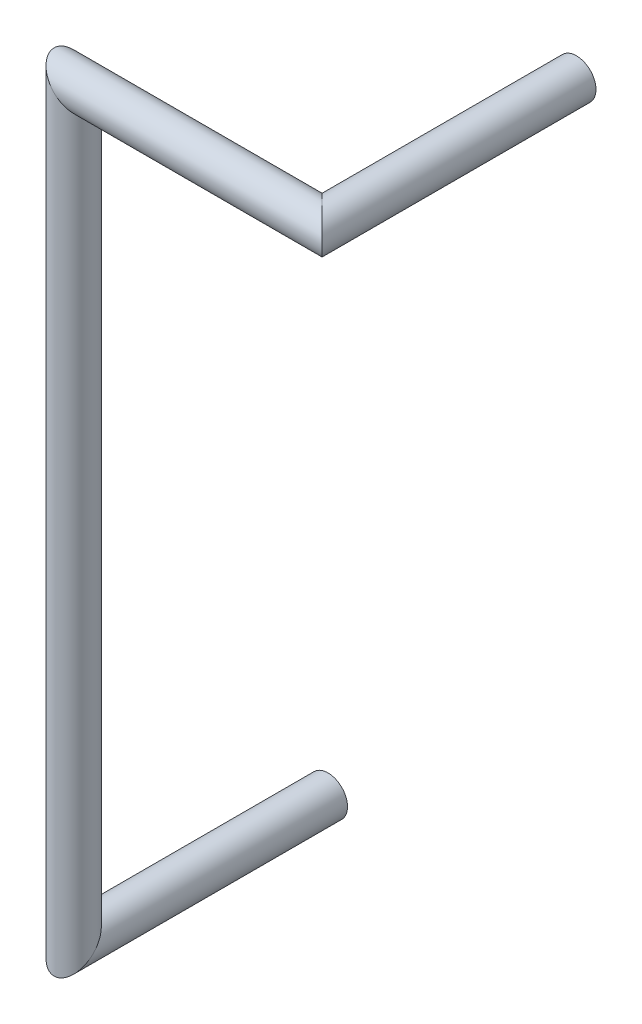
ISO-10303-21;
HEADER;
FILE_DESCRIPTION(('STEP AP214'),'2;1');
FILE_NAME('part.step','',(''),(''),'','','');
FILE_SCHEMA(('AUTOMOTIVE_DESIGN { 1 0 10303 214 1 1 1 1 }'));
ENDSEC;
DATA;
#1=APPLICATION_CONTEXT('core data for automotive mechanical design processes');
#2=APPLICATION_PROTOCOL_DEFINITION('international standard','automotive_design',2000,#1);
#3=PRODUCT_CONTEXT('',#1,'mechanical');
#4=PRODUCT('Part','Part','',(#3));
#5=PRODUCT_RELATED_PRODUCT_CATEGORY('part','',(#4));
#6=PRODUCT_DEFINITION_FORMATION('','',#4);
#7=PRODUCT_DEFINITION_CONTEXT('part definition',#1,'design');
#8=PRODUCT_DEFINITION('design','',#6,#7);
#9=PRODUCT_DEFINITION_SHAPE('','',#8);
#10=(LENGTH_UNIT() NAMED_UNIT(*) SI_UNIT(.MILLI.,.METRE.));
#11=(NAMED_UNIT(*) PLANE_ANGLE_UNIT() SI_UNIT($,.RADIAN.));
#12=(NAMED_UNIT(*) SI_UNIT($,.STERADIAN.) SOLID_ANGLE_UNIT());
#13=UNCERTAINTY_MEASURE_WITH_UNIT(LENGTH_MEASURE(1.E-05),#10,'distance_accuracy_value','');
#14=(GEOMETRIC_REPRESENTATION_CONTEXT(3) GLOBAL_UNCERTAINTY_ASSIGNED_CONTEXT((#13)) GLOBAL_UNIT_ASSIGNED_CONTEXT((#10,
#11,#12)) REPRESENTATION_CONTEXT('',''));
#15=CARTESIAN_POINT('',(0.,0.,0.));
#16=DIRECTION('',(0.,0.,1.));
#17=DIRECTION('',(1.,0.,0.));
#18=AXIS2_PLACEMENT_3D('',#15,#16,#17);
#19=CARTESIAN_POINT('',(2.54,7.62,0.));
#20=DIRECTION('',(0.,0.,1.));
#21=DIRECTION('',(1.,0.,0.));
#22=AXIS2_PLACEMENT_3D('',#19,#20,#21);
#23=PLANE('',#22);
#24=CARTESIAN_POINT('',(2.54,7.62,0.));
#25=DIRECTION('',(0.,0.,1.));
#26=DIRECTION('',(1.,0.,0.));
#27=AXIS2_PLACEMENT_3D('',#24,#25,#26);
#28=CIRCLE('',#27,0.2);
#29=CARTESIAN_POINT('',(2.74,7.62,0.));
#30=VERTEX_POINT('',#29);
#31=EDGE_CURVE('E58',#30,#30,#28,.T.);
#32=ORIENTED_EDGE('',*,*,#31,.F.);
#33=EDGE_LOOP('',(#32));
#34=FACE_BOUND('',#33,.T.);
#35=ADVANCED_FACE('F55',(#34),#23,.F.);
#36=CARTESIAN_POINT('',(0.,0.,0.));
#37=DIRECTION('',(0.,0.,-1.));
#38=DIRECTION('',(0.,-1.,0.));
#39=AXIS2_PLACEMENT_3D('',#36,#37,#38);
#40=PLANE('',#39);
#41=CARTESIAN_POINT('',(0.,0.,0.));
#42=DIRECTION('',(0.,0.,-1.));
#43=DIRECTION('',(0.,-1.,0.));
#44=AXIS2_PLACEMENT_3D('',#41,#42,#43);
#45=CIRCLE('',#44,0.2);
#46=CARTESIAN_POINT('',(0.,-0.2,0.));
#47=VERTEX_POINT('',#46);
#48=EDGE_CURVE('E63',#47,#47,#45,.T.);
#49=ORIENTED_EDGE('',*,*,#48,.T.);
#50=EDGE_LOOP('',(#49));
#51=FACE_BOUND('',#50,.T.);
#52=ADVANCED_FACE('F86',(#51),#40,.T.);
#53=CARTESIAN_POINT('',(2.54,7.62,2.92));
#54=DIRECTION('',(0.,0.,-1.));
#55=DIRECTION('',(-1.,0.,0.));
#56=AXIS2_PLACEMENT_3D('',#53,#54,#55);
#57=CYLINDRICAL_SURFACE('',#56,0.2);
#58=CARTESIAN_POINT('',(2.54,7.62,2.6));
#59=DIRECTION('',(0.707106781186548,0.,-0.707106781186548));
#60=DIRECTION('',(0.707106781186548,0.,0.707106781186548));
#61=AXIS2_PLACEMENT_3D('',#58,#59,#60);
#62=ELLIPSE('',#61,0.282842712474619,0.2);
#63=CARTESIAN_POINT('',(2.74,7.62,2.8));
#64=VERTEX_POINT('',#63);
#65=EDGE_CURVE('E74',#64,#64,#62,.T.);
#66=ORIENTED_EDGE('',*,*,#65,.T.);
#67=EDGE_LOOP('',(#66));
#68=FACE_BOUND('',#67,.T.);
#69=ORIENTED_EDGE('',*,*,#31,.T.);
#70=EDGE_LOOP('',(#69));
#71=FACE_BOUND('',#70,.T.);
#72=ADVANCED_FACE('F83',(#68,#71),#57,.T.);
#73=CARTESIAN_POINT('',(-0.539999999999999,7.62,2.6));
#74=DIRECTION('',(1.,0.,0.));
#75=DIRECTION('',(0.,0.,-1.));
#76=AXIS2_PLACEMENT_3D('',#73,#74,#75);
#77=CYLINDRICAL_SURFACE('',#76,0.2);
#78=CARTESIAN_POINT('',(0.,7.62,2.6));
#79=DIRECTION('',(0.707106781186548,0.707106781186548,0.));
#80=DIRECTION('',(-0.707106781186548,0.707106781186548,0.));
#81=AXIS2_PLACEMENT_3D('',#78,#79,#80);
#82=ELLIPSE('',#81,0.282842712474619,0.2);
#83=CARTESIAN_POINT('',(-0.2,7.82,2.6));
#84=VERTEX_POINT('',#83);
#85=EDGE_CURVE('E69',#84,#84,#82,.T.);
#86=ORIENTED_EDGE('',*,*,#85,.T.);
#87=EDGE_LOOP('',(#86));
#88=FACE_BOUND('',#87,.T.);
#89=ORIENTED_EDGE('',*,*,#65,.F.);
#90=EDGE_LOOP('',(#89));
#91=FACE_BOUND('',#90,.T.);
#92=ADVANCED_FACE('F99',(#88,#91),#77,.T.);
#93=CARTESIAN_POINT('',(0.,-0.32,2.6));
#94=DIRECTION('',(0.,1.,0.));
#95=DIRECTION('',(-1.,0.,0.));
#96=AXIS2_PLACEMENT_3D('',#93,#94,#95);
#97=CYLINDRICAL_SURFACE('',#96,0.2);
#98=CARTESIAN_POINT('',(0.,0.,2.6));
#99=DIRECTION('',(0.,0.707106781186548,0.707106781186548));
#100=DIRECTION('',(0.,-0.707106781186548,0.707106781186548));
#101=AXIS2_PLACEMENT_3D('',#98,#99,#100);
#102=ELLIPSE('',#101,0.282842712474619,0.2);
#103=CARTESIAN_POINT('',(0.,-0.2,2.8));
#104=VERTEX_POINT('',#103);
#105=EDGE_CURVE('E11',#104,#104,#102,.T.);
#106=ORIENTED_EDGE('',*,*,#105,.T.);
#107=EDGE_LOOP('',(#106));
#108=FACE_BOUND('',#107,.T.);
#109=ORIENTED_EDGE('',*,*,#85,.F.);
#110=EDGE_LOOP('',(#109));
#111=FACE_BOUND('',#110,.T.);
#112=ADVANCED_FACE('F93',(#108,#111),#97,.T.);
#113=CARTESIAN_POINT('',(0.,0.,0.));
#114=DIRECTION('',(0.,0.,1.));
#115=DIRECTION('',(1.,0.,0.));
#116=AXIS2_PLACEMENT_3D('',#113,#114,#115);
#117=CYLINDRICAL_SURFACE('',#116,0.2);
#118=ORIENTED_EDGE('',*,*,#48,.F.);
#119=EDGE_LOOP('',(#118));
#120=FACE_BOUND('',#119,.T.);
#121=ORIENTED_EDGE('',*,*,#105,.F.);
#122=EDGE_LOOP('',(#121));
#123=FACE_BOUND('',#122,.T.);
#124=ADVANCED_FACE('F91',(#120,#123),#117,.T.);
#125=CLOSED_SHELL('',(#35,#52,#72,#92,#112,#124));
#126=MANIFOLD_SOLID_BREP('B2',#125);
#127=ADVANCED_BREP_SHAPE_REPRESENTATION('',(#18,#126),#14);
#128=SHAPE_DEFINITION_REPRESENTATION(#9,#127);
ENDSEC;
END-ISO-10303-21;
